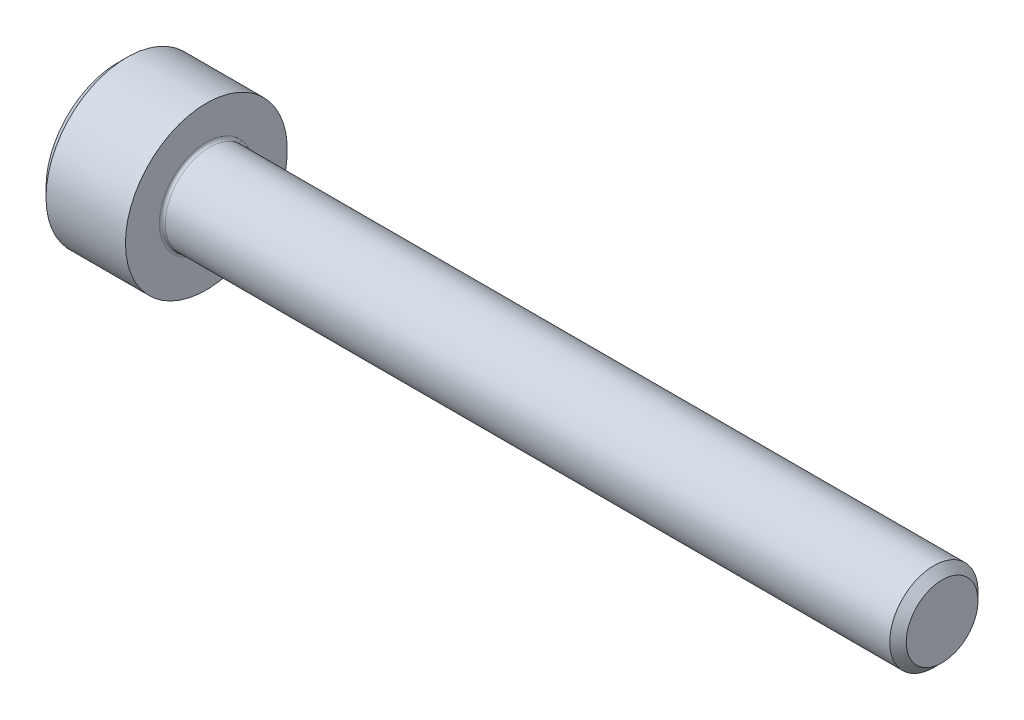
ISO-10303-21;
HEADER;
FILE_DESCRIPTION(('STEP AP214'),'2;1');
FILE_NAME('part.step','',(''),(''),'','','');
FILE_SCHEMA(('AUTOMOTIVE_DESIGN { 1 0 10303 214 1 1 1 1 }'));
ENDSEC;
DATA;
#1=APPLICATION_CONTEXT('core data for automotive mechanical design processes');
#2=APPLICATION_PROTOCOL_DEFINITION('international standard','automotive_design',2000,#1);
#3=PRODUCT_CONTEXT('',#1,'mechanical');
#4=PRODUCT('Part','Part','',(#3));
#5=PRODUCT_RELATED_PRODUCT_CATEGORY('part','',(#4));
#6=PRODUCT_DEFINITION_FORMATION('','',#4);
#7=PRODUCT_DEFINITION_CONTEXT('part definition',#1,'design');
#8=PRODUCT_DEFINITION('design','',#6,#7);
#9=PRODUCT_DEFINITION_SHAPE('','',#8);
#10=(LENGTH_UNIT() NAMED_UNIT(*) SI_UNIT(.MILLI.,.METRE.));
#11=(NAMED_UNIT(*) PLANE_ANGLE_UNIT() SI_UNIT($,.RADIAN.));
#12=(NAMED_UNIT(*) SI_UNIT($,.STERADIAN.) SOLID_ANGLE_UNIT());
#13=UNCERTAINTY_MEASURE_WITH_UNIT(LENGTH_MEASURE(1.E-05),#10,'distance_accuracy_value','');
#14=(GEOMETRIC_REPRESENTATION_CONTEXT(3) GLOBAL_UNCERTAINTY_ASSIGNED_CONTEXT((#13)) GLOBAL_UNIT_ASSIGNED_CONTEXT((#10,
#11,#12)) REPRESENTATION_CONTEXT('',''));
#15=CARTESIAN_POINT('',(0.,0.,0.));
#16=DIRECTION('',(0.,0.,1.));
#17=DIRECTION('',(1.,0.,0.));
#18=AXIS2_PLACEMENT_3D('',#15,#16,#17);
#19=CARTESIAN_POINT('',(0.,0.,0.));
#20=DIRECTION('',(-1.,0.,0.));
#21=DIRECTION('',(0.,0.,1.));
#22=AXIS2_PLACEMENT_3D('',#19,#20,#21);
#23=PLANE('',#22);
#24=DIRECTION('',(0.,-0.499999999999999,0.866025403784439));
#25=VECTOR('',#24,1.);
#26=CARTESIAN_POINT('',(0.,1.47801668912544,0.));
#27=LINE('',#26,#25);
#28=CARTESIAN_POINT('',(0.,1.47801668912544,0.));
#29=VERTEX_POINT('',#28);
#30=CARTESIAN_POINT('',(0.,0.739008344562721,1.28));
#31=VERTEX_POINT('',#30);
#32=EDGE_CURVE('E261',#29,#31,#27,.T.);
#33=ORIENTED_EDGE('',*,*,#32,.T.);
#34=DIRECTION('',(0.,1.,0.));
#35=VECTOR('',#34,1.);
#36=CARTESIAN_POINT('',(0.,-0.739008344562721,1.28));
#37=LINE('',#36,#35);
#38=CARTESIAN_POINT('',(0.,-0.739008344562721,1.28));
#39=VERTEX_POINT('',#38);
#40=EDGE_CURVE('E132',#39,#31,#37,.T.);
#41=ORIENTED_EDGE('',*,*,#40,.F.);
#42=DIRECTION('',(0.,-0.500000000000001,-0.866025403784438));
#43=VECTOR('',#42,1.);
#44=CARTESIAN_POINT('',(0.,-0.739008344562721,1.28));
#45=LINE('',#44,#43);
#46=CARTESIAN_POINT('',(0.,-1.47801668912544,0.));
#47=VERTEX_POINT('',#46);
#48=EDGE_CURVE('E264',#39,#47,#45,.T.);
#49=ORIENTED_EDGE('',*,*,#48,.T.);
#50=DIRECTION('',(0.,0.499999999999999,-0.866025403784439));
#51=VECTOR('',#50,1.);
#52=CARTESIAN_POINT('',(0.,-1.47801668912544,0.));
#53=LINE('',#52,#51);
#54=CARTESIAN_POINT('',(0.,-0.739008344562724,-1.28));
#55=VERTEX_POINT('',#54);
#56=EDGE_CURVE('E267',#47,#55,#53,.T.);
#57=ORIENTED_EDGE('',*,*,#56,.T.);
#58=DIRECTION('',(0.,-1.,0.));
#59=VECTOR('',#58,1.);
#60=CARTESIAN_POINT('',(0.,0.739008344562718,-1.28));
#61=LINE('',#60,#59);
#62=CARTESIAN_POINT('',(0.,0.739008344562718,-1.28));
#63=VERTEX_POINT('',#62);
#64=EDGE_CURVE('E270',#63,#55,#61,.T.);
#65=ORIENTED_EDGE('',*,*,#64,.F.);
#66=DIRECTION('',(0.,-0.500000000000001,-0.866025403784438));
#67=VECTOR('',#66,1.);
#68=CARTESIAN_POINT('',(0.,1.47801668912544,0.));
#69=LINE('',#68,#67);
#70=EDGE_CURVE('E127',#29,#63,#69,.T.);
#71=ORIENTED_EDGE('',*,*,#70,.F.);
#72=EDGE_LOOP('',(#33,#41,#49,#57,#65,#71));
#73=FACE_BOUND('',#72,.T.);
#74=CARTESIAN_POINT('',(0.,0.,0.));
#75=DIRECTION('',(-1.,0.,0.));
#76=DIRECTION('',(0.,0.,1.));
#77=AXIS2_PLACEMENT_3D('',#74,#75,#76);
#78=CIRCLE('',#77,2.45);
#79=CARTESIAN_POINT('',(0.,0.,2.45));
#80=VERTEX_POINT('',#79);
#81=EDGE_CURVE('E156',#80,#80,#78,.T.);
#82=ORIENTED_EDGE('',*,*,#81,.T.);
#83=EDGE_LOOP('',(#82));
#84=FACE_BOUND('',#83,.T.);
#85=ADVANCED_FACE('F36',(#73,#84),#23,.T.);
#86=CARTESIAN_POINT('',(0.,0.,0.));
#87=DIRECTION('',(1.,0.,0.));
#88=DIRECTION('',(0.,0.,-1.));
#89=AXIS2_PLACEMENT_3D('',#86,#87,#88);
#90=CONICAL_SURFACE('',#89,2.45,0.785398163397441);
#91=CARTESIAN_POINT('',(0.300000000000002,0.,0.));
#92=DIRECTION('',(-1.,0.,0.));
#93=DIRECTION('',(0.,0.,1.));
#94=AXIS2_PLACEMENT_3D('',#91,#92,#93);
#95=CIRCLE('',#94,2.75);
#96=CARTESIAN_POINT('',(0.300000000000002,0.,2.75));
#97=VERTEX_POINT('',#96);
#98=EDGE_CURVE('E153',#97,#97,#95,.T.);
#99=ORIENTED_EDGE('',*,*,#98,.T.);
#100=EDGE_LOOP('',(#99));
#101=FACE_BOUND('',#100,.T.);
#102=ORIENTED_EDGE('',*,*,#81,.F.);
#103=EDGE_LOOP('',(#102));
#104=FACE_BOUND('',#103,.T.);
#105=ADVANCED_FACE('F177',(#101,#104),#90,.T.);
#106=CARTESIAN_POINT('',(-31.75,0.,0.));
#107=DIRECTION('',(-1.,0.,0.));
#108=DIRECTION('',(0.,0.,1.));
#109=AXIS2_PLACEMENT_3D('',#106,#107,#108);
#110=CYLINDRICAL_SURFACE('',#109,2.75);
#111=CARTESIAN_POINT('',(3.,0.,0.));
#112=DIRECTION('',(-1.,0.,0.));
#113=DIRECTION('',(0.,0.,1.));
#114=AXIS2_PLACEMENT_3D('',#111,#112,#113);
#115=CIRCLE('',#114,2.75);
#116=CARTESIAN_POINT('',(3.,0.,2.75));
#117=VERTEX_POINT('',#116);
#118=EDGE_CURVE('E150',#117,#117,#115,.T.);
#119=ORIENTED_EDGE('',*,*,#118,.T.);
#120=EDGE_LOOP('',(#119));
#121=FACE_BOUND('',#120,.T.);
#122=ORIENTED_EDGE('',*,*,#98,.F.);
#123=EDGE_LOOP('',(#122));
#124=FACE_BOUND('',#123,.T.);
#125=ADVANCED_FACE('F182',(#121,#124),#110,.T.);
#126=CARTESIAN_POINT('',(3.,2.75,0.));
#127=DIRECTION('',(1.,0.,0.));
#128=DIRECTION('',(0.,0.,-1.));
#129=AXIS2_PLACEMENT_3D('',#126,#127,#128);
#130=PLANE('',#129);
#131=CARTESIAN_POINT('',(3.,0.,0.));
#132=DIRECTION('',(1.,0.,0.));
#133=DIRECTION('',(0.,0.,-1.));
#134=AXIS2_PLACEMENT_3D('',#131,#132,#133);
#135=CIRCLE('',#134,1.59999999999999);
#136=CARTESIAN_POINT('',(3.,0.,-1.59999999999999));
#137=VERTEX_POINT('',#136);
#138=EDGE_CURVE('E44',#137,#137,#135,.F.);
#139=ORIENTED_EDGE('',*,*,#138,.T.);
#140=EDGE_LOOP('',(#139));
#141=FACE_BOUND('',#140,.T.);
#142=ORIENTED_EDGE('',*,*,#118,.F.);
#143=EDGE_LOOP('',(#142));
#144=FACE_BOUND('',#143,.T.);
#145=ADVANCED_FACE('F161',(#141,#144),#130,.T.);
#146=CARTESIAN_POINT('',(-31.75,0.,0.));
#147=DIRECTION('',(-1.,0.,0.));
#148=DIRECTION('',(0.,0.,1.));
#149=AXIS2_PLACEMENT_3D('',#146,#147,#148);
#150=CYLINDRICAL_SURFACE('',#149,1.49999999999999);
#151=CARTESIAN_POINT('',(3.1,0.,0.));
#152=DIRECTION('',(1.,0.,0.));
#153=DIRECTION('',(0.,0.,-1.));
#154=AXIS2_PLACEMENT_3D('',#151,#152,#153);
#155=CIRCLE('',#154,1.49999999999999);
#156=CARTESIAN_POINT('',(3.1,0.,-1.49999999999999));
#157=VERTEX_POINT('',#156);
#158=EDGE_CURVE('E11',#157,#157,#155,.T.);
#159=ORIENTED_EDGE('',*,*,#158,.T.);
#160=EDGE_LOOP('',(#159));
#161=FACE_BOUND('',#160,.T.);
#162=CARTESIAN_POINT('',(27.7195,0.,0.));
#163=DIRECTION('',(-1.,0.,0.));
#164=DIRECTION('',(0.,0.,1.));
#165=AXIS2_PLACEMENT_3D('',#162,#163,#164);
#166=CIRCLE('',#165,1.49999999999998);
#167=CARTESIAN_POINT('',(27.7195,0.,1.49999999999998));
#168=VERTEX_POINT('',#167);
#169=EDGE_CURVE('E147',#168,#168,#166,.T.);
#170=ORIENTED_EDGE('',*,*,#169,.T.);
#171=EDGE_LOOP('',(#170));
#172=FACE_BOUND('',#171,.T.);
#173=ADVANCED_FACE('F192',(#161,#172),#150,.T.);
#174=CARTESIAN_POINT('',(28.,0.,0.));
#175=DIRECTION('',(-1.,0.,0.));
#176=DIRECTION('',(0.,0.,1.));
#177=AXIS2_PLACEMENT_3D('',#174,#175,#176);
#178=CONICAL_SURFACE('',#177,1.2195,0.785398163397403);
#179=ORIENTED_EDGE('',*,*,#169,.F.);
#180=EDGE_LOOP('',(#179));
#181=FACE_BOUND('',#180,.T.);
#182=CARTESIAN_POINT('',(28.,0.,0.));
#183=DIRECTION('',(-1.,0.,0.));
#184=DIRECTION('',(0.,0.,1.));
#185=AXIS2_PLACEMENT_3D('',#182,#183,#184);
#186=CIRCLE('',#185,1.2195);
#187=CARTESIAN_POINT('',(28.,0.,1.2195));
#188=VERTEX_POINT('',#187);
#189=EDGE_CURVE('E143',#188,#188,#186,.T.);
#190=ORIENTED_EDGE('',*,*,#189,.T.);
#191=EDGE_LOOP('',(#190));
#192=FACE_BOUND('',#191,.T.);
#193=ADVANCED_FACE('F172',(#181,#192),#178,.T.);
#194=CARTESIAN_POINT('',(28.,1.2195,0.));
#195=DIRECTION('',(1.,0.,0.));
#196=DIRECTION('',(0.,0.,-1.));
#197=AXIS2_PLACEMENT_3D('',#194,#195,#196);
#198=PLANE('',#197);
#199=ORIENTED_EDGE('',*,*,#189,.F.);
#200=EDGE_LOOP('',(#199));
#201=FACE_BOUND('',#200,.T.);
#202=ADVANCED_FACE('F165',(#201),#198,.T.);
#203=CARTESIAN_POINT('',(3.1,0.,0.));
#204=DIRECTION('',(1.,0.,0.));
#205=DIRECTION('',(0.,0.,-1.));
#206=AXIS2_PLACEMENT_3D('',#203,#204,#205);
#207=TOROIDAL_SURFACE('',#206,1.59999999999999,0.1);
#208=ORIENTED_EDGE('',*,*,#158,.F.);
#209=EDGE_LOOP('',(#208));
#210=FACE_BOUND('',#209,.T.);
#211=ORIENTED_EDGE('',*,*,#138,.F.);
#212=EDGE_LOOP('',(#211));
#213=FACE_BOUND('',#212,.T.);
#214=ADVANCED_FACE('F38',(#210,#213),#207,.F.);
#215=CARTESIAN_POINT('',(1.3,1.47801668912544,0.));
#216=DIRECTION('',(0.,-0.866025403784439,-0.499999999999999));
#217=DIRECTION('',(0.,0.499999999999999,-0.866025403784439));
#218=AXIS2_PLACEMENT_3D('',#215,#216,#217);
#219=PLANE('',#218);
#220=ORIENTED_EDGE('',*,*,#32,.F.);
#221=DIRECTION('',(-1.,0.,0.));
#222=VECTOR('',#221,1.);
#223=CARTESIAN_POINT('',(1.3,1.47801668912544,0.));
#224=LINE('',#223,#222);
#225=CARTESIAN_POINT('',(1.3,1.47801668912544,0.));
#226=VERTEX_POINT('',#225);
#227=EDGE_CURVE('E251',#226,#29,#224,.T.);
#228=ORIENTED_EDGE('',*,*,#227,.F.);
#229=DIRECTION('',(0.,-0.499999999999999,0.866025403784439));
#230=VECTOR('',#229,1.);
#231=CARTESIAN_POINT('',(1.3,1.47801668912544,0.));
#232=LINE('',#231,#230);
#233=CARTESIAN_POINT('',(1.3,1.10851251684408,0.639999999999998));
#234=VERTEX_POINT('',#233);
#235=EDGE_CURVE('E119',#226,#234,#232,.T.);
#236=ORIENTED_EDGE('',*,*,#235,.T.);
#237=CARTESIAN_POINT('',(1.3,0.739008344562721,1.28));
#238=VERTEX_POINT('',#237);
#239=EDGE_CURVE('E110',#234,#238,#232,.T.);
#240=ORIENTED_EDGE('',*,*,#239,.T.);
#241=DIRECTION('',(-1.,0.,0.));
#242=VECTOR('',#241,1.);
#243=CARTESIAN_POINT('',(1.3,0.739008344562721,1.28));
#244=LINE('',#243,#242);
#245=EDGE_CURVE('E124',#238,#31,#244,.T.);
#246=ORIENTED_EDGE('',*,*,#245,.T.);
#247=EDGE_LOOP('',(#220,#228,#236,#240,#246));
#248=FACE_BOUND('',#247,.T.);
#249=ADVANCED_FACE('F123',(#248),#219,.T.);
#250=CARTESIAN_POINT('',(1.3,-0.739008344562721,1.28));
#251=DIRECTION('',(0.,0.,1.));
#252=DIRECTION('',(0.,-1.,0.));
#253=AXIS2_PLACEMENT_3D('',#250,#251,#252);
#254=PLANE('',#253);
#255=ORIENTED_EDGE('',*,*,#40,.T.);
#256=ORIENTED_EDGE('',*,*,#245,.F.);
#257=DIRECTION('',(0.,1.,0.));
#258=VECTOR('',#257,1.);
#259=CARTESIAN_POINT('',(1.3,-0.739008344562721,1.28));
#260=LINE('',#259,#258);
#261=CARTESIAN_POINT('',(1.3,0.,1.28));
#262=VERTEX_POINT('',#261);
#263=EDGE_CURVE('E107',#262,#238,#260,.T.);
#264=ORIENTED_EDGE('',*,*,#263,.F.);
#265=CARTESIAN_POINT('',(1.3,-0.739008344562721,1.28));
#266=VERTEX_POINT('',#265);
#267=EDGE_CURVE('E118',#266,#262,#260,.T.);
#268=ORIENTED_EDGE('',*,*,#267,.F.);
#269=DIRECTION('',(-1.,0.,0.));
#270=VECTOR('',#269,1.);
#271=CARTESIAN_POINT('',(1.3,-0.739008344562721,1.28));
#272=LINE('',#271,#270);
#273=EDGE_CURVE('E134',#266,#39,#272,.T.);
#274=ORIENTED_EDGE('',*,*,#273,.T.);
#275=EDGE_LOOP('',(#255,#256,#264,#268,#274));
#276=FACE_BOUND('',#275,.T.);
#277=ADVANCED_FACE('F129',(#276),#254,.F.);
#278=CARTESIAN_POINT('',(1.3,-0.739008344562721,1.28));
#279=DIRECTION('',(0.,0.866025403784438,-0.500000000000001));
#280=DIRECTION('',(0.,0.500000000000001,0.866025403784438));
#281=AXIS2_PLACEMENT_3D('',#278,#279,#280);
#282=PLANE('',#281);
#283=ORIENTED_EDGE('',*,*,#48,.F.);
#284=ORIENTED_EDGE('',*,*,#273,.F.);
#285=DIRECTION('',(0.,-0.500000000000001,-0.866025403784438));
#286=VECTOR('',#285,1.);
#287=CARTESIAN_POINT('',(1.3,-0.739008344562721,1.28));
#288=LINE('',#287,#286);
#289=CARTESIAN_POINT('',(1.3,-1.10851251684408,0.640000000000002));
#290=VERTEX_POINT('',#289);
#291=EDGE_CURVE('E290',#266,#290,#288,.T.);
#292=ORIENTED_EDGE('',*,*,#291,.T.);
#293=CARTESIAN_POINT('',(1.3,-1.47801668912544,0.));
#294=VERTEX_POINT('',#293);
#295=EDGE_CURVE('E279',#290,#294,#288,.T.);
#296=ORIENTED_EDGE('',*,*,#295,.T.);
#297=DIRECTION('',(-1.,0.,0.));
#298=VECTOR('',#297,1.);
#299=CARTESIAN_POINT('',(1.3,-1.47801668912544,0.));
#300=LINE('',#299,#298);
#301=EDGE_CURVE('E139',#294,#47,#300,.T.);
#302=ORIENTED_EDGE('',*,*,#301,.T.);
#303=EDGE_LOOP('',(#283,#284,#292,#296,#302));
#304=FACE_BOUND('',#303,.T.);
#305=ADVANCED_FACE('F205',(#304),#282,.T.);
#306=CARTESIAN_POINT('',(1.3,-1.47801668912544,0.));
#307=DIRECTION('',(0.,0.866025403784439,0.499999999999999));
#308=DIRECTION('',(0.,-0.499999999999999,0.866025403784439));
#309=AXIS2_PLACEMENT_3D('',#306,#307,#308);
#310=PLANE('',#309);
#311=ORIENTED_EDGE('',*,*,#56,.F.);
#312=ORIENTED_EDGE('',*,*,#301,.F.);
#313=DIRECTION('',(0.,0.499999999999999,-0.866025403784439));
#314=VECTOR('',#313,1.);
#315=CARTESIAN_POINT('',(1.3,-1.47801668912544,0.));
#316=LINE('',#315,#314);
#317=CARTESIAN_POINT('',(1.3,-1.10851251684409,-0.64));
#318=VERTEX_POINT('',#317);
#319=EDGE_CURVE('E257',#294,#318,#316,.T.);
#320=ORIENTED_EDGE('',*,*,#319,.T.);
#321=CARTESIAN_POINT('',(1.3,-0.739008344562724,-1.28));
#322=VERTEX_POINT('',#321);
#323=EDGE_CURVE('E289',#318,#322,#316,.T.);
#324=ORIENTED_EDGE('',*,*,#323,.T.);
#325=DIRECTION('',(-1.,0.,0.));
#326=VECTOR('',#325,1.);
#327=CARTESIAN_POINT('',(1.3,-0.739008344562724,-1.28));
#328=LINE('',#327,#326);
#329=EDGE_CURVE('E250',#322,#55,#328,.T.);
#330=ORIENTED_EDGE('',*,*,#329,.T.);
#331=EDGE_LOOP('',(#311,#312,#320,#324,#330));
#332=FACE_BOUND('',#331,.T.);
#333=ADVANCED_FACE('F208',(#332),#310,.T.);
#334=CARTESIAN_POINT('',(1.3,0.739008344562718,-1.28));
#335=DIRECTION('',(0.,0.,-1.));
#336=DIRECTION('',(0.,1.,0.));
#337=AXIS2_PLACEMENT_3D('',#334,#335,#336);
#338=PLANE('',#337);
#339=ORIENTED_EDGE('',*,*,#64,.T.);
#340=ORIENTED_EDGE('',*,*,#329,.F.);
#341=DIRECTION('',(0.,-1.,0.));
#342=VECTOR('',#341,1.);
#343=CARTESIAN_POINT('',(1.3,0.739008344562718,-1.28));
#344=LINE('',#343,#342);
#345=CARTESIAN_POINT('',(1.3,0.,-1.28));
#346=VERTEX_POINT('',#345);
#347=EDGE_CURVE('E254',#346,#322,#344,.T.);
#348=ORIENTED_EDGE('',*,*,#347,.F.);
#349=CARTESIAN_POINT('',(1.3,0.739008344562718,-1.28));
#350=VERTEX_POINT('',#349);
#351=EDGE_CURVE('E51',#350,#346,#344,.T.);
#352=ORIENTED_EDGE('',*,*,#351,.F.);
#353=DIRECTION('',(-1.,0.,0.));
#354=VECTOR('',#353,1.);
#355=CARTESIAN_POINT('',(1.3,0.739008344562718,-1.28));
#356=LINE('',#355,#354);
#357=EDGE_CURVE('E247',#350,#63,#356,.T.);
#358=ORIENTED_EDGE('',*,*,#357,.T.);
#359=EDGE_LOOP('',(#339,#340,#348,#352,#358));
#360=FACE_BOUND('',#359,.T.);
#361=ADVANCED_FACE('F212',(#360),#338,.F.);
#362=CARTESIAN_POINT('',(1.3,1.47801668912544,0.));
#363=DIRECTION('',(0.,0.866025403784438,-0.500000000000001));
#364=DIRECTION('',(0.,0.500000000000001,0.866025403784438));
#365=AXIS2_PLACEMENT_3D('',#362,#363,#364);
#366=PLANE('',#365);
#367=ORIENTED_EDGE('',*,*,#70,.T.);
#368=ORIENTED_EDGE('',*,*,#357,.F.);
#369=DIRECTION('',(0.,-0.500000000000001,-0.866025403784438));
#370=VECTOR('',#369,1.);
#371=CARTESIAN_POINT('',(1.3,1.47801668912544,0.));
#372=LINE('',#371,#370);
#373=CARTESIAN_POINT('',(1.3,1.10851251684408,-0.640000000000002));
#374=VERTEX_POINT('',#373);
#375=EDGE_CURVE('E237',#374,#350,#372,.T.);
#376=ORIENTED_EDGE('',*,*,#375,.F.);
#377=EDGE_CURVE('E243',#226,#374,#372,.T.);
#378=ORIENTED_EDGE('',*,*,#377,.F.);
#379=ORIENTED_EDGE('',*,*,#227,.T.);
#380=EDGE_LOOP('',(#367,#368,#376,#378,#379));
#381=FACE_BOUND('',#380,.T.);
#382=ADVANCED_FACE('F216',(#381),#366,.F.);
#383=CARTESIAN_POINT('',(1.3,1.47801668912544,0.));
#384=DIRECTION('',(1.,0.,0.));
#385=DIRECTION('',(0.,0.,-1.));
#386=AXIS2_PLACEMENT_3D('',#383,#384,#385);
#387=PLANE('',#386);
#388=ORIENTED_EDGE('',*,*,#347,.T.);
#389=ORIENTED_EDGE('',*,*,#323,.F.);
#390=CARTESIAN_POINT('',(1.3,0.,0.));
#391=DIRECTION('',(-1.,0.,0.));
#392=DIRECTION('',(0.,0.,1.));
#393=AXIS2_PLACEMENT_3D('',#390,#391,#392);
#394=CIRCLE('',#393,1.28);
#395=EDGE_CURVE('E285',#346,#318,#394,.T.);
#396=ORIENTED_EDGE('',*,*,#395,.F.);
#397=EDGE_LOOP('',(#388,#389,#396));
#398=FACE_BOUND('',#397,.T.);
#399=ADVANCED_FACE('F220',(#398),#387,.F.);
#400=ORIENTED_EDGE('',*,*,#319,.F.);
#401=ORIENTED_EDGE('',*,*,#295,.F.);
#402=EDGE_CURVE('E137',#318,#290,#394,.T.);
#403=ORIENTED_EDGE('',*,*,#402,.F.);
#404=EDGE_LOOP('',(#400,#401,#403));
#405=FACE_BOUND('',#404,.T.);
#406=ADVANCED_FACE('F223',(#405),#387,.F.);
#407=ORIENTED_EDGE('',*,*,#291,.F.);
#408=ORIENTED_EDGE('',*,*,#267,.T.);
#409=EDGE_CURVE('E133',#290,#262,#394,.T.);
#410=ORIENTED_EDGE('',*,*,#409,.F.);
#411=EDGE_LOOP('',(#407,#408,#410));
#412=FACE_BOUND('',#411,.T.);
#413=ADVANCED_FACE('F228',(#412),#387,.F.);
#414=ORIENTED_EDGE('',*,*,#263,.T.);
#415=ORIENTED_EDGE('',*,*,#239,.F.);
#416=EDGE_CURVE('E113',#262,#234,#394,.T.);
#417=ORIENTED_EDGE('',*,*,#416,.F.);
#418=EDGE_LOOP('',(#414,#415,#417));
#419=FACE_BOUND('',#418,.T.);
#420=ADVANCED_FACE('F109',(#419),#387,.F.);
#421=ORIENTED_EDGE('',*,*,#235,.F.);
#422=ORIENTED_EDGE('',*,*,#377,.T.);
#423=EDGE_CURVE('E144',#234,#374,#394,.T.);
#424=ORIENTED_EDGE('',*,*,#423,.F.);
#425=EDGE_LOOP('',(#421,#422,#424));
#426=FACE_BOUND('',#425,.T.);
#427=ADVANCED_FACE('F231',(#426),#387,.F.);
#428=ORIENTED_EDGE('',*,*,#375,.T.);
#429=ORIENTED_EDGE('',*,*,#351,.T.);
#430=EDGE_CURVE('E240',#374,#346,#394,.T.);
#431=ORIENTED_EDGE('',*,*,#430,.F.);
#432=EDGE_LOOP('',(#428,#429,#431));
#433=FACE_BOUND('',#432,.T.);
#434=ADVANCED_FACE('F201',(#433),#387,.F.);
#435=CARTESIAN_POINT('',(1.3,0.,0.));
#436=DIRECTION('',(-1.,0.,0.));
#437=DIRECTION('',(0.,0.,1.));
#438=AXIS2_PLACEMENT_3D('',#435,#436,#437);
#439=CONICAL_SURFACE('',#438,1.28,1.0471975511966);
#440=CARTESIAN_POINT('',(2.03900834456273,0.,0.));
#441=VERTEX_POINT('',#440);
#442=VERTEX_LOOP('',#441);
#443=FACE_BOUND('',#442,.T.);
#444=ORIENTED_EDGE('',*,*,#416,.T.);
#445=ORIENTED_EDGE('',*,*,#423,.T.);
#446=ORIENTED_EDGE('',*,*,#430,.T.);
#447=ORIENTED_EDGE('',*,*,#395,.T.);
#448=ORIENTED_EDGE('',*,*,#402,.T.);
#449=ORIENTED_EDGE('',*,*,#409,.T.);
#450=EDGE_LOOP('',(#444,#445,#446,#447,#448,#449));
#451=FACE_BOUND('',#450,.T.);
#452=ADVANCED_FACE('F199',(#443,#451),#439,.F.);
#453=CLOSED_SHELL('',(#85,#105,#125,#145,#173,#193,#202,#214,#249,#277,#305,#333,#361,#382,#399,
#406,#413,#420,#427,#434,#452));
#454=MANIFOLD_SOLID_BREP('B2',#453);
#455=ADVANCED_BREP_SHAPE_REPRESENTATION('',(#18,#454),#14);
#456=SHAPE_DEFINITION_REPRESENTATION(#9,#455);
ENDSEC;
END-ISO-10303-21;
